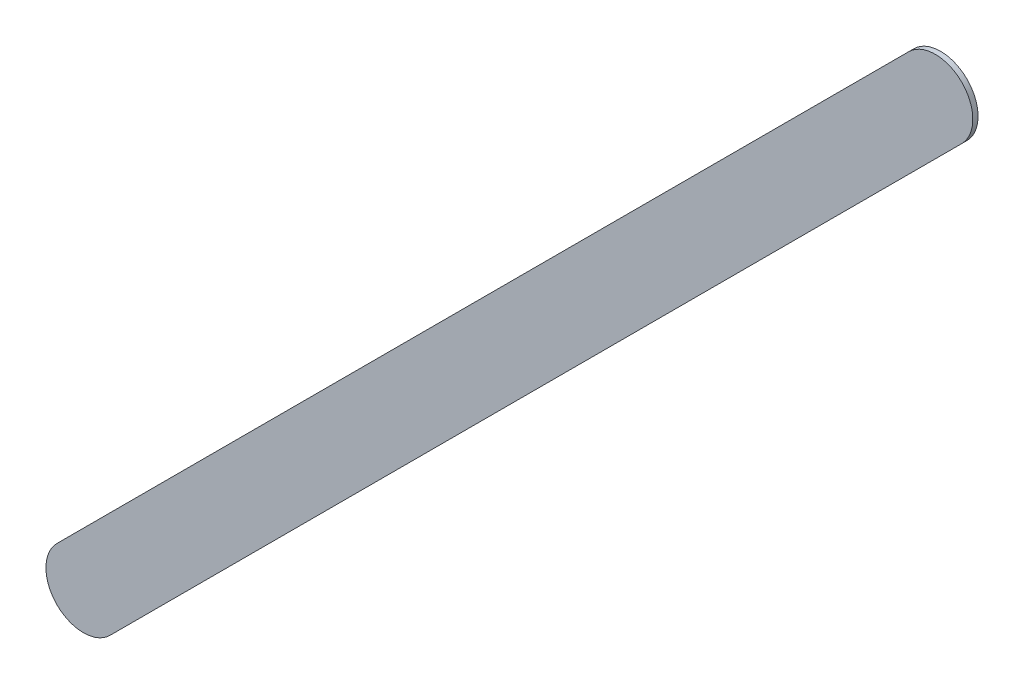
ISO-10303-21;
HEADER;
FILE_DESCRIPTION(('STEP AP214'),'2;1');
FILE_NAME('part.step','',(''),(''),'','','');
FILE_SCHEMA(('AUTOMOTIVE_DESIGN { 1 0 10303 214 1 1 1 1 }'));
ENDSEC;
DATA;
#1=APPLICATION_CONTEXT('core data for automotive mechanical design processes');
#2=APPLICATION_PROTOCOL_DEFINITION('international standard','automotive_design',2000,#1);
#3=PRODUCT_CONTEXT('',#1,'mechanical');
#4=PRODUCT('Part','Part','',(#3));
#5=PRODUCT_RELATED_PRODUCT_CATEGORY('part','',(#4));
#6=PRODUCT_DEFINITION_FORMATION('','',#4);
#7=PRODUCT_DEFINITION_CONTEXT('part definition',#1,'design');
#8=PRODUCT_DEFINITION('design','',#6,#7);
#9=PRODUCT_DEFINITION_SHAPE('','',#8);
#10=(LENGTH_UNIT() NAMED_UNIT(*) SI_UNIT(.MILLI.,.METRE.));
#11=(NAMED_UNIT(*) PLANE_ANGLE_UNIT() SI_UNIT($,.RADIAN.));
#12=(NAMED_UNIT(*) SI_UNIT($,.STERADIAN.) SOLID_ANGLE_UNIT());
#13=UNCERTAINTY_MEASURE_WITH_UNIT(LENGTH_MEASURE(1.E-05),#10,'distance_accuracy_value','');
#14=(GEOMETRIC_REPRESENTATION_CONTEXT(3) GLOBAL_UNCERTAINTY_ASSIGNED_CONTEXT((#13)) GLOBAL_UNIT_ASSIGNED_CONTEXT((#10,
#11,#12)) REPRESENTATION_CONTEXT('',''));
#15=CARTESIAN_POINT('',(0.,0.,0.));
#16=DIRECTION('',(0.,0.,1.));
#17=DIRECTION('',(1.,0.,0.));
#18=AXIS2_PLACEMENT_3D('',#15,#16,#17);
#19=CARTESIAN_POINT('',(168.225223,-147.397223,0.));
#20=DIRECTION('',(0.,0.,1.));
#21=DIRECTION('',(1.,0.,0.));
#22=AXIS2_PLACEMENT_3D('',#19,#20,#21);
#23=PLANE('',#22);
#24=DIRECTION('',(-0.707106781186548,-0.707106781186548,0.));
#25=VECTOR('',#24,1.);
#26=CARTESIAN_POINT('',(168.225223,-147.397223,0.));
#27=LINE('',#26,#25);
#28=CARTESIAN_POINT('',(168.225223,-147.397223,0.));
#29=VERTEX_POINT('',#28);
#30=CARTESIAN_POINT('',(162.550223,-153.072223,0.));
#31=VERTEX_POINT('',#30);
#32=EDGE_CURVE('E95',#29,#31,#27,.T.);
#33=ORIENTED_EDGE('',*,*,#32,.T.);
#34=CARTESIAN_POINT('',(162.7269995,-153.2489995,0.));
#35=DIRECTION('',(0.,0.,1.));
#36=DIRECTION('',(-0.707106781186048,0.707106781187048,0.));
#37=AXIS2_PLACEMENT_3D('',#34,#35,#36);
#38=CIRCLE('',#37,0.249999723809);
#39=CARTESIAN_POINT('',(162.903776,-153.425776,0.));
#40=VERTEX_POINT('',#39);
#41=EDGE_CURVE('E74',#31,#40,#38,.T.);
#42=ORIENTED_EDGE('',*,*,#41,.T.);
#43=DIRECTION('',(0.707106781186548,0.707106781186548,0.));
#44=VECTOR('',#43,1.);
#45=CARTESIAN_POINT('',(162.903776,-153.425776,0.));
#46=LINE('',#45,#44);
#47=CARTESIAN_POINT('',(168.578776,-147.750776,0.));
#48=VERTEX_POINT('',#47);
#49=EDGE_CURVE('E79',#40,#48,#46,.T.);
#50=ORIENTED_EDGE('',*,*,#49,.T.);
#51=CARTESIAN_POINT('',(168.4019995,-147.5739995,0.));
#52=DIRECTION('',(0.,0.,1.));
#53=DIRECTION('',(0.707106781187048,-0.707106781186048,0.));
#54=AXIS2_PLACEMENT_3D('',#51,#52,#53);
#55=CIRCLE('',#54,0.249999723809);
#56=EDGE_CURVE('E11',#48,#29,#55,.T.);
#57=ORIENTED_EDGE('',*,*,#56,.T.);
#58=EDGE_LOOP('',(#33,#42,#50,#57));
#59=FACE_BOUND('',#58,.T.);
#60=ADVANCED_FACE('F17',(#59),#23,.T.);
#61=CARTESIAN_POINT('',(168.225223,-147.397223,-0.035));
#62=DIRECTION('',(0.,0.,1.));
#63=DIRECTION('',(1.,0.,0.));
#64=AXIS2_PLACEMENT_3D('',#61,#62,#63);
#65=PLANE('',#64);
#66=CARTESIAN_POINT('',(168.4019995,-147.5739995,-0.035));
#67=DIRECTION('',(0.,0.,1.));
#68=DIRECTION('',(0.707106781187048,-0.707106781186048,0.));
#69=AXIS2_PLACEMENT_3D('',#66,#67,#68);
#70=CIRCLE('',#69,0.249999723809);
#71=CARTESIAN_POINT('',(168.578776,-147.750776,-0.035));
#72=VERTEX_POINT('',#71);
#73=CARTESIAN_POINT('',(168.225223,-147.397223,-0.035));
#74=VERTEX_POINT('',#73);
#75=EDGE_CURVE('E25',#72,#74,#70,.T.);
#76=ORIENTED_EDGE('',*,*,#75,.F.);
#77=DIRECTION('',(0.707106781186548,0.707106781186548,0.));
#78=VECTOR('',#77,1.);
#79=CARTESIAN_POINT('',(162.903776,-153.425776,-0.035));
#80=LINE('',#79,#78);
#81=CARTESIAN_POINT('',(162.903776,-153.425776,-0.035));
#82=VERTEX_POINT('',#81);
#83=EDGE_CURVE('E64',#82,#72,#80,.T.);
#84=ORIENTED_EDGE('',*,*,#83,.F.);
#85=CARTESIAN_POINT('',(162.7269995,-153.2489995,-0.035));
#86=DIRECTION('',(0.,0.,1.));
#87=DIRECTION('',(-0.707106781186048,0.707106781187048,0.));
#88=AXIS2_PLACEMENT_3D('',#85,#86,#87);
#89=CIRCLE('',#88,0.249999723809);
#90=CARTESIAN_POINT('',(162.550223,-153.072223,-0.035));
#91=VERTEX_POINT('',#90);
#92=EDGE_CURVE('E68',#91,#82,#89,.T.);
#93=ORIENTED_EDGE('',*,*,#92,.F.);
#94=DIRECTION('',(-0.707106781186548,-0.707106781186548,0.));
#95=VECTOR('',#94,1.);
#96=CARTESIAN_POINT('',(168.225223,-147.397223,-0.035));
#97=LINE('',#96,#95);
#98=EDGE_CURVE('E113',#74,#91,#97,.T.);
#99=ORIENTED_EDGE('',*,*,#98,.F.);
#100=EDGE_LOOP('',(#76,#84,#93,#99));
#101=FACE_BOUND('',#100,.T.);
#102=ADVANCED_FACE('F66',(#101),#65,.F.);
#103=CARTESIAN_POINT('',(168.4019995,-147.5739995,-0.035));
#104=DIRECTION('',(0.,0.,-1.));
#105=DIRECTION('',(0.707106781187048,-0.707106781186048,0.));
#106=AXIS2_PLACEMENT_3D('',#103,#104,#105);
#107=CYLINDRICAL_SURFACE('',#106,0.249999723809);
#108=ORIENTED_EDGE('',*,*,#75,.T.);
#109=DIRECTION('',(0.,0.,1.));
#110=VECTOR('',#109,1.);
#111=CARTESIAN_POINT('',(168.225223,-147.397223,-0.035));
#112=LINE('',#111,#110);
#113=EDGE_CURVE('E89',#74,#29,#112,.T.);
#114=ORIENTED_EDGE('',*,*,#113,.T.);
#115=ORIENTED_EDGE('',*,*,#56,.F.);
#116=DIRECTION('',(0.,0.,1.));
#117=VECTOR('',#116,1.);
#118=CARTESIAN_POINT('',(168.578776,-147.750776,-0.035));
#119=LINE('',#118,#117);
#120=EDGE_CURVE('E73',#72,#48,#119,.T.);
#121=ORIENTED_EDGE('',*,*,#120,.F.);
#122=EDGE_LOOP('',(#108,#114,#115,#121));
#123=FACE_BOUND('',#122,.T.);
#124=ADVANCED_FACE('F108',(#123),#107,.T.);
#125=CARTESIAN_POINT('',(162.903776,-153.425776,-0.035));
#126=DIRECTION('',(-0.707106781186548,0.707106781186548,0.));
#127=DIRECTION('',(0.,0.,1.));
#128=AXIS2_PLACEMENT_3D('',#125,#126,#127);
#129=PLANE('',#128);
#130=ORIENTED_EDGE('',*,*,#83,.T.);
#131=ORIENTED_EDGE('',*,*,#120,.T.);
#132=ORIENTED_EDGE('',*,*,#49,.F.);
#133=DIRECTION('',(0.,0.,1.));
#134=VECTOR('',#133,1.);
#135=CARTESIAN_POINT('',(162.903776,-153.425776,-0.035));
#136=LINE('',#135,#134);
#137=EDGE_CURVE('E77',#82,#40,#136,.T.);
#138=ORIENTED_EDGE('',*,*,#137,.F.);
#139=EDGE_LOOP('',(#130,#131,#132,#138));
#140=FACE_BOUND('',#139,.T.);
#141=ADVANCED_FACE('F78',(#140),#129,.F.);
#142=CARTESIAN_POINT('',(162.7269995,-153.2489995,-0.035));
#143=DIRECTION('',(0.,0.,-1.));
#144=DIRECTION('',(-0.707106781186048,0.707106781187048,0.));
#145=AXIS2_PLACEMENT_3D('',#142,#143,#144);
#146=CYLINDRICAL_SURFACE('',#145,0.249999723809);
#147=ORIENTED_EDGE('',*,*,#92,.T.);
#148=ORIENTED_EDGE('',*,*,#137,.T.);
#149=ORIENTED_EDGE('',*,*,#41,.F.);
#150=DIRECTION('',(0.,0.,1.));
#151=VECTOR('',#150,1.);
#152=CARTESIAN_POINT('',(162.550223,-153.072223,-0.035));
#153=LINE('',#152,#151);
#154=EDGE_CURVE('E86',#91,#31,#153,.T.);
#155=ORIENTED_EDGE('',*,*,#154,.F.);
#156=EDGE_LOOP('',(#147,#148,#149,#155));
#157=FACE_BOUND('',#156,.T.);
#158=ADVANCED_FACE('F84',(#157),#146,.T.);
#159=CARTESIAN_POINT('',(168.225223,-147.397223,-0.035));
#160=DIRECTION('',(0.707106781186548,-0.707106781186548,0.));
#161=DIRECTION('',(0.,0.,-1.));
#162=AXIS2_PLACEMENT_3D('',#159,#160,#161);
#163=PLANE('',#162);
#164=ORIENTED_EDGE('',*,*,#98,.T.);
#165=ORIENTED_EDGE('',*,*,#154,.T.);
#166=ORIENTED_EDGE('',*,*,#32,.F.);
#167=ORIENTED_EDGE('',*,*,#113,.F.);
#168=EDGE_LOOP('',(#164,#165,#166,#167));
#169=FACE_BOUND('',#168,.T.);
#170=ADVANCED_FACE('F112',(#169),#163,.F.);
#171=CLOSED_SHELL('',(#60,#102,#124,#141,#158,#170));
#172=MANIFOLD_SOLID_BREP('B1',#171);
#173=ADVANCED_BREP_SHAPE_REPRESENTATION('',(#18,#172),#14);
#174=SHAPE_DEFINITION_REPRESENTATION(#9,#173);
ENDSEC;
END-ISO-10303-21;
